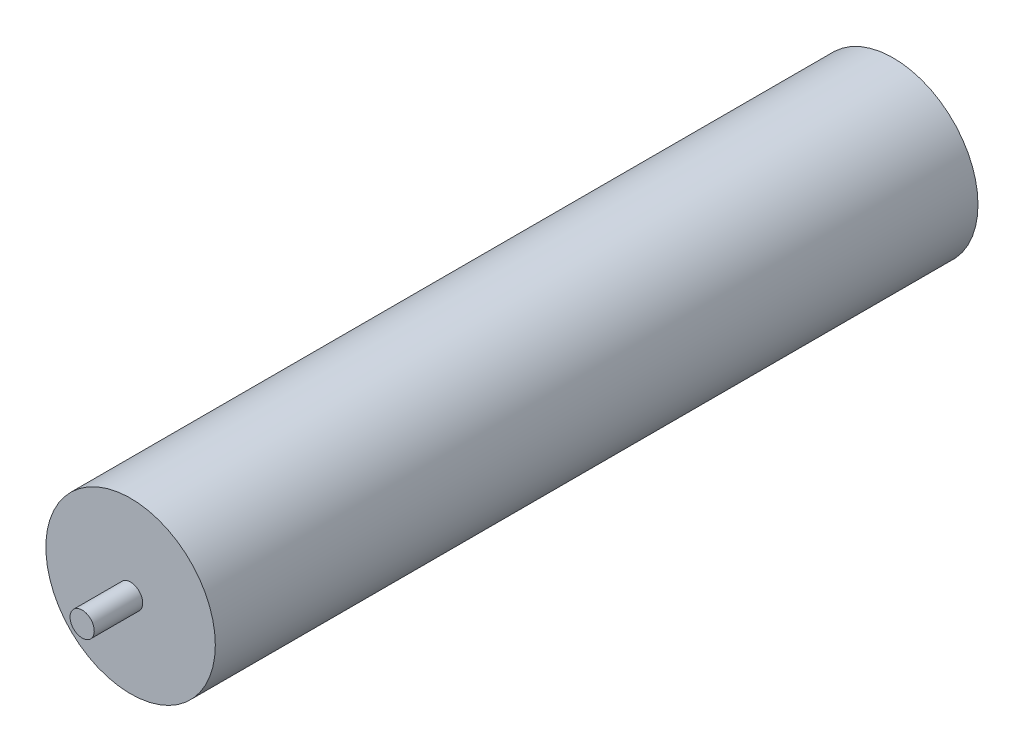
ISO-10303-21;
HEADER;
FILE_DESCRIPTION(('STEP AP214'),'2;1');
FILE_NAME('part.step','',(''),(''),'','','');
FILE_SCHEMA(('AUTOMOTIVE_DESIGN { 1 0 10303 214 1 1 1 1 }'));
ENDSEC;
DATA;
#1=APPLICATION_CONTEXT('core data for automotive mechanical design processes');
#2=APPLICATION_PROTOCOL_DEFINITION('international standard','automotive_design',2000,#1);
#3=PRODUCT_CONTEXT('',#1,'mechanical');
#4=PRODUCT('Part','Part','',(#3));
#5=PRODUCT_RELATED_PRODUCT_CATEGORY('part','',(#4));
#6=PRODUCT_DEFINITION_FORMATION('','',#4);
#7=PRODUCT_DEFINITION_CONTEXT('part definition',#1,'design');
#8=PRODUCT_DEFINITION('design','',#6,#7);
#9=PRODUCT_DEFINITION_SHAPE('','',#8);
#10=(LENGTH_UNIT() NAMED_UNIT(*) SI_UNIT(.MILLI.,.METRE.));
#11=(NAMED_UNIT(*) PLANE_ANGLE_UNIT() SI_UNIT($,.RADIAN.));
#12=(NAMED_UNIT(*) SI_UNIT($,.STERADIAN.) SOLID_ANGLE_UNIT());
#13=UNCERTAINTY_MEASURE_WITH_UNIT(LENGTH_MEASURE(1.E-05),#10,'distance_accuracy_value','');
#14=(GEOMETRIC_REPRESENTATION_CONTEXT(3) GLOBAL_UNCERTAINTY_ASSIGNED_CONTEXT((#13)) GLOBAL_UNIT_ASSIGNED_CONTEXT((#10,
#11,#12)) REPRESENTATION_CONTEXT('',''));
#15=CARTESIAN_POINT('',(0.,0.,0.));
#16=DIRECTION('',(0.,0.,1.));
#17=DIRECTION('',(1.,0.,0.));
#18=AXIS2_PLACEMENT_3D('',#15,#16,#17);
#19=CARTESIAN_POINT('',(0.,0.,315.));
#20=DIRECTION('',(0.,0.,-1.));
#21=DIRECTION('',(-1.,0.,0.));
#22=AXIS2_PLACEMENT_3D('',#19,#20,#21);
#23=CYLINDRICAL_SURFACE('',#22,35.);
#24=CARTESIAN_POINT('',(0.,0.,315.));
#25=DIRECTION('',(0.,0.,1.));
#26=DIRECTION('',(1.,0.,0.));
#27=AXIS2_PLACEMENT_3D('',#24,#25,#26);
#28=CIRCLE('',#27,35.);
#29=CARTESIAN_POINT('',(35.,0.,315.));
#30=VERTEX_POINT('',#29);
#31=EDGE_CURVE('E39',#30,#30,#28,.T.);
#32=ORIENTED_EDGE('',*,*,#31,.F.);
#33=EDGE_LOOP('',(#32));
#34=FACE_BOUND('',#33,.T.);
#35=CARTESIAN_POINT('',(0.,0.,0.));
#36=DIRECTION('',(0.,0.,1.));
#37=DIRECTION('',(1.,0.,0.));
#38=AXIS2_PLACEMENT_3D('',#35,#36,#37);
#39=CIRCLE('',#38,35.);
#40=CARTESIAN_POINT('',(35.,0.,0.));
#41=VERTEX_POINT('',#40);
#42=EDGE_CURVE('E43',#41,#41,#39,.T.);
#43=ORIENTED_EDGE('',*,*,#42,.T.);
#44=EDGE_LOOP('',(#43));
#45=FACE_BOUND('',#44,.T.);
#46=ADVANCED_FACE('F33',(#34,#45),#23,.T.);
#47=CARTESIAN_POINT('',(0.,0.,315.));
#48=DIRECTION('',(0.,0.,1.));
#49=DIRECTION('',(1.,0.,0.));
#50=AXIS2_PLACEMENT_3D('',#47,#48,#49);
#51=PLANE('',#50);
#52=CARTESIAN_POINT('',(0.,0.,315.));
#53=DIRECTION('',(0.,0.,1.));
#54=DIRECTION('',(1.,0.,0.));
#55=AXIS2_PLACEMENT_3D('',#52,#53,#54);
#56=CIRCLE('',#55,5.);
#57=CARTESIAN_POINT('',(5.,0.,315.));
#58=VERTEX_POINT('',#57);
#59=EDGE_CURVE('E50',#58,#58,#56,.T.);
#60=ORIENTED_EDGE('',*,*,#59,.F.);
#61=EDGE_LOOP('',(#60));
#62=FACE_BOUND('',#61,.T.);
#63=ORIENTED_EDGE('',*,*,#31,.T.);
#64=EDGE_LOOP('',(#63));
#65=FACE_BOUND('',#64,.T.);
#66=ADVANCED_FACE('F74',(#62,#65),#51,.T.);
#67=CARTESIAN_POINT('',(0.,0.,0.));
#68=DIRECTION('',(0.,0.,1.));
#69=DIRECTION('',(1.,0.,0.));
#70=AXIS2_PLACEMENT_3D('',#67,#68,#69);
#71=PLANE('',#70);
#72=CARTESIAN_POINT('',(0.,0.,0.));
#73=DIRECTION('',(0.,0.,1.));
#74=DIRECTION('',(1.,0.,0.));
#75=AXIS2_PLACEMENT_3D('',#72,#73,#74);
#76=CIRCLE('',#75,5.);
#77=CARTESIAN_POINT('',(5.,0.,0.));
#78=VERTEX_POINT('',#77);
#79=EDGE_CURVE('E10',#78,#78,#76,.F.);
#80=ORIENTED_EDGE('',*,*,#79,.F.);
#81=EDGE_LOOP('',(#80));
#82=FACE_BOUND('',#81,.T.);
#83=ORIENTED_EDGE('',*,*,#42,.F.);
#84=EDGE_LOOP('',(#83));
#85=FACE_BOUND('',#84,.T.);
#86=ADVANCED_FACE('F79',(#82,#85),#71,.F.);
#87=CARTESIAN_POINT('',(0.,0.,335.));
#88=DIRECTION('',(0.,0.,-1.));
#89=DIRECTION('',(-1.,0.,0.));
#90=AXIS2_PLACEMENT_3D('',#87,#88,#89);
#91=CYLINDRICAL_SURFACE('',#90,5.);
#92=CARTESIAN_POINT('',(0.,0.,335.));
#93=DIRECTION('',(0.,0.,1.));
#94=DIRECTION('',(1.,0.,0.));
#95=AXIS2_PLACEMENT_3D('',#92,#93,#94);
#96=CIRCLE('',#95,5.);
#97=CARTESIAN_POINT('',(5.,0.,335.));
#98=VERTEX_POINT('',#97);
#99=EDGE_CURVE('E48',#98,#98,#96,.T.);
#100=ORIENTED_EDGE('',*,*,#99,.F.);
#101=EDGE_LOOP('',(#100));
#102=FACE_BOUND('',#101,.T.);
#103=ORIENTED_EDGE('',*,*,#59,.T.);
#104=EDGE_LOOP('',(#103));
#105=FACE_BOUND('',#104,.T.);
#106=ADVANCED_FACE('F70',(#102,#105),#91,.T.);
#107=CARTESIAN_POINT('',(0.,0.,335.));
#108=DIRECTION('',(0.,0.,1.));
#109=DIRECTION('',(1.,0.,0.));
#110=AXIS2_PLACEMENT_3D('',#107,#108,#109);
#111=PLANE('',#110);
#112=ORIENTED_EDGE('',*,*,#99,.T.);
#113=EDGE_LOOP('',(#112));
#114=FACE_BOUND('',#113,.T.);
#115=ADVANCED_FACE('F63',(#114),#111,.T.);
#116=CARTESIAN_POINT('',(0.,0.,-20.));
#117=DIRECTION('',(0.,0.,1.));
#118=DIRECTION('',(1.,0.,0.));
#119=AXIS2_PLACEMENT_3D('',#116,#117,#118);
#120=CYLINDRICAL_SURFACE('',#119,5.);
#121=CARTESIAN_POINT('',(0.,0.,-20.));
#122=DIRECTION('',(0.,0.,-1.));
#123=DIRECTION('',(-1.,0.,0.));
#124=AXIS2_PLACEMENT_3D('',#121,#122,#123);
#125=CIRCLE('',#124,5.);
#126=CARTESIAN_POINT('',(-5.,0.,-20.));
#127=VERTEX_POINT('',#126);
#128=EDGE_CURVE('E53',#127,#127,#125,.T.);
#129=ORIENTED_EDGE('',*,*,#128,.F.);
#130=EDGE_LOOP('',(#129));
#131=FACE_BOUND('',#130,.T.);
#132=ORIENTED_EDGE('',*,*,#79,.T.);
#133=EDGE_LOOP('',(#132));
#134=FACE_BOUND('',#133,.T.);
#135=ADVANCED_FACE('F61',(#131,#134),#120,.T.);
#136=CARTESIAN_POINT('',(0.,0.,-20.));
#137=DIRECTION('',(0.,0.,-1.));
#138=DIRECTION('',(-1.,0.,0.));
#139=AXIS2_PLACEMENT_3D('',#136,#137,#138);
#140=PLANE('',#139);
#141=ORIENTED_EDGE('',*,*,#128,.T.);
#142=EDGE_LOOP('',(#141));
#143=FACE_BOUND('',#142,.T.);
#144=ADVANCED_FACE('F59',(#143),#140,.T.);
#145=CLOSED_SHELL('',(#46,#66,#86,#106,#115,#135,#144));
#146=MANIFOLD_SOLID_BREP('B2',#145);
#147=ADVANCED_BREP_SHAPE_REPRESENTATION('',(#18,#146),#14);
#148=SHAPE_DEFINITION_REPRESENTATION(#9,#147);
ENDSEC;
END-ISO-10303-21;
